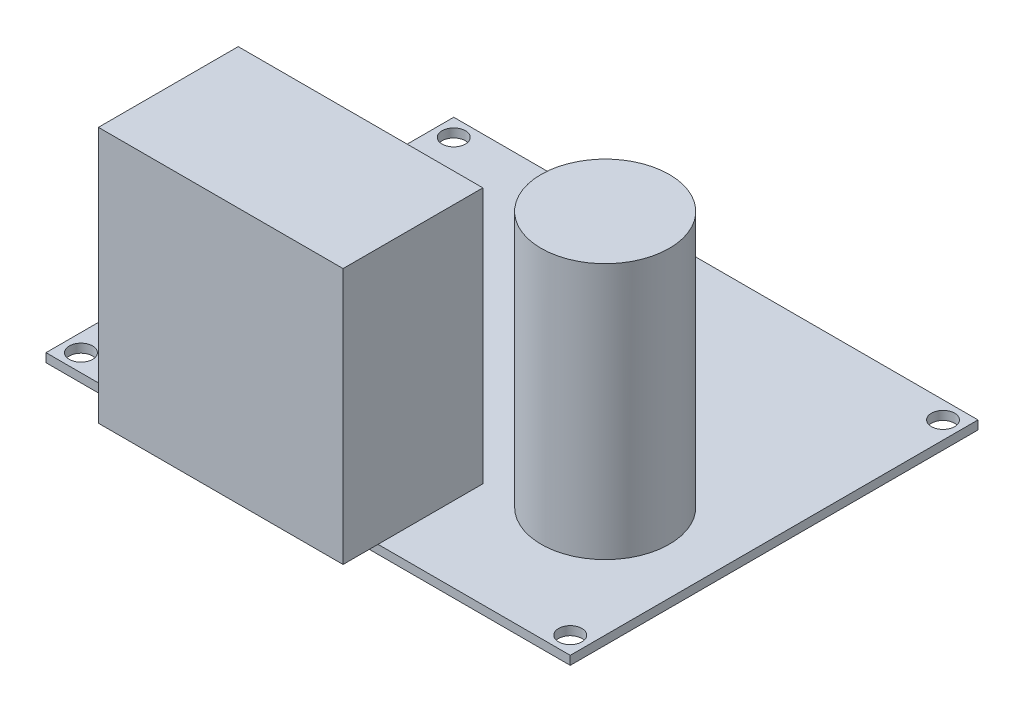
ISO-10303-21;
HEADER;
FILE_DESCRIPTION(('STEP AP214'),'2;1');
FILE_NAME('part.step','',(''),(''),'','','');
FILE_SCHEMA(('AUTOMOTIVE_DESIGN { 1 0 10303 214 1 1 1 1 }'));
ENDSEC;
DATA;
#1=APPLICATION_CONTEXT('core data for automotive mechanical design processes');
#2=APPLICATION_PROTOCOL_DEFINITION('international standard','automotive_design',2000,#1);
#3=PRODUCT_CONTEXT('',#1,'mechanical');
#4=PRODUCT('Part','Part','',(#3));
#5=PRODUCT_RELATED_PRODUCT_CATEGORY('part','',(#4));
#6=PRODUCT_DEFINITION_FORMATION('','',#4);
#7=PRODUCT_DEFINITION_CONTEXT('part definition',#1,'design');
#8=PRODUCT_DEFINITION('design','',#6,#7);
#9=PRODUCT_DEFINITION_SHAPE('','',#8);
#10=(LENGTH_UNIT() NAMED_UNIT(*) SI_UNIT(.MILLI.,.METRE.));
#11=(NAMED_UNIT(*) PLANE_ANGLE_UNIT() SI_UNIT($,.RADIAN.));
#12=(NAMED_UNIT(*) SI_UNIT($,.STERADIAN.) SOLID_ANGLE_UNIT());
#13=UNCERTAINTY_MEASURE_WITH_UNIT(LENGTH_MEASURE(1.E-05),#10,'distance_accuracy_value','');
#14=(GEOMETRIC_REPRESENTATION_CONTEXT(3) GLOBAL_UNCERTAINTY_ASSIGNED_CONTEXT((#13)) GLOBAL_UNIT_ASSIGNED_CONTEXT((#10,
#11,#12)) REPRESENTATION_CONTEXT('',''));
#15=CARTESIAN_POINT('',(0.,0.,0.));
#16=DIRECTION('',(0.,0.,1.));
#17=DIRECTION('',(1.,0.,0.));
#18=AXIS2_PLACEMENT_3D('',#15,#16,#17);
#19=CARTESIAN_POINT('',(0.,1.5,0.));
#20=DIRECTION('',(0.,-1.,0.));
#21=DIRECTION('',(0.,0.,-1.));
#22=AXIS2_PLACEMENT_3D('',#19,#20,#21);
#23=PLANE('',#22);
#24=CARTESIAN_POINT('',(87.,1.5,-3.));
#25=DIRECTION('',(0.,1.,0.));
#26=DIRECTION('',(0.,0.,1.));
#27=AXIS2_PLACEMENT_3D('',#24,#25,#26);
#28=CIRCLE('',#27,2.);
#29=CARTESIAN_POINT('',(87.,1.5,-1.));
#30=VERTEX_POINT('',#29);
#31=EDGE_CURVE('E157',#30,#30,#28,.T.);
#32=ORIENTED_EDGE('',*,*,#31,.F.);
#33=EDGE_LOOP('',(#32));
#34=FACE_BOUND('',#33,.T.);
#35=CARTESIAN_POINT('',(3.,1.5,-67.0000000000001));
#36=DIRECTION('',(0.,1.,0.));
#37=DIRECTION('',(0.,0.,1.));
#38=AXIS2_PLACEMENT_3D('',#35,#36,#37);
#39=CIRCLE('',#38,2.);
#40=CARTESIAN_POINT('',(3.,1.5,-65.0000000000001));
#41=VERTEX_POINT('',#40);
#42=EDGE_CURVE('E147',#41,#41,#39,.T.);
#43=ORIENTED_EDGE('',*,*,#42,.F.);
#44=EDGE_LOOP('',(#43));
#45=FACE_BOUND('',#44,.T.);
#46=CARTESIAN_POINT('',(3.,1.5,-3.));
#47=DIRECTION('',(0.,1.,0.));
#48=DIRECTION('',(0.,0.,1.));
#49=AXIS2_PLACEMENT_3D('',#46,#47,#48);
#50=CIRCLE('',#49,2.);
#51=CARTESIAN_POINT('',(3.,1.5,-1.));
#52=VERTEX_POINT('',#51);
#53=EDGE_CURVE('E151',#52,#52,#50,.T.);
#54=ORIENTED_EDGE('',*,*,#53,.F.);
#55=EDGE_LOOP('',(#54));
#56=FACE_BOUND('',#55,.T.);
#57=CARTESIAN_POINT('',(87.,1.5,-67.0000000000001));
#58=DIRECTION('',(0.,1.,0.));
#59=DIRECTION('',(0.,0.,1.));
#60=AXIS2_PLACEMENT_3D('',#57,#58,#59);
#61=CIRCLE('',#60,2.);
#62=CARTESIAN_POINT('',(87.,1.5,-65.0000000000001));
#63=VERTEX_POINT('',#62);
#64=EDGE_CURVE('E158',#63,#63,#61,.T.);
#65=ORIENTED_EDGE('',*,*,#64,.F.);
#66=EDGE_LOOP('',(#65));
#67=FACE_BOUND('',#66,.T.);
#68=CARTESIAN_POINT('',(71.,1.5,-25.));
#69=DIRECTION('',(0.,-1.,0.));
#70=DIRECTION('',(0.,0.,-1.));
#71=AXIS2_PLACEMENT_3D('',#68,#69,#70);
#72=CIRCLE('',#71,11.);
#73=CARTESIAN_POINT('',(71.,1.5,-36.));
#74=VERTEX_POINT('',#73);
#75=EDGE_CURVE('E41',#74,#74,#72,.F.);
#76=ORIENTED_EDGE('',*,*,#75,.F.);
#77=EDGE_LOOP('',(#76));
#78=FACE_BOUND('',#77,.T.);
#79=DIRECTION('',(0.,0.,1.));
#80=VECTOR('',#79,1.);
#81=CARTESIAN_POINT('',(15.,1.5,0.));
#82=LINE('',#81,#80);
#83=CARTESIAN_POINT('',(15.,1.5,-18.));
#84=VERTEX_POINT('',#83);
#85=CARTESIAN_POINT('',(15.,1.5,0.));
#86=VERTEX_POINT('',#85);
#87=EDGE_CURVE('E132',#84,#86,#82,.T.);
#88=ORIENTED_EDGE('',*,*,#87,.F.);
#89=DIRECTION('',(-1.,0.,0.));
#90=VECTOR('',#89,1.);
#91=CARTESIAN_POINT('',(15.,1.5,-18.));
#92=LINE('',#91,#90);
#93=CARTESIAN_POINT('',(57.,1.5,-18.));
#94=VERTEX_POINT('',#93);
#95=EDGE_CURVE('E48',#94,#84,#92,.T.);
#96=ORIENTED_EDGE('',*,*,#95,.F.);
#97=DIRECTION('',(0.,0.,-1.));
#98=VECTOR('',#97,1.);
#99=CARTESIAN_POINT('',(57.,1.5,0.));
#100=LINE('',#99,#98);
#101=CARTESIAN_POINT('',(57.,1.5,0.));
#102=VERTEX_POINT('',#101);
#103=EDGE_CURVE('E11',#102,#94,#100,.T.);
#104=ORIENTED_EDGE('',*,*,#103,.F.);
#105=DIRECTION('',(1.,0.,0.));
#106=VECTOR('',#105,1.);
#107=CARTESIAN_POINT('',(0.,1.5,0.));
#108=LINE('',#107,#106);
#109=CARTESIAN_POINT('',(90.,1.5,0.));
#110=VERTEX_POINT('',#109);
#111=EDGE_CURVE('E175',#102,#110,#108,.T.);
#112=ORIENTED_EDGE('',*,*,#111,.T.);
#113=DIRECTION('',(0.,0.,-1.));
#114=VECTOR('',#113,1.);
#115=CARTESIAN_POINT('',(90.,1.5,0.));
#116=LINE('',#115,#114);
#117=CARTESIAN_POINT('',(90.,1.5,-70.0000000000001));
#118=VERTEX_POINT('',#117);
#119=EDGE_CURVE('E180',#110,#118,#116,.T.);
#120=ORIENTED_EDGE('',*,*,#119,.T.);
#121=DIRECTION('',(-1.,0.,0.));
#122=VECTOR('',#121,1.);
#123=CARTESIAN_POINT('',(0.,1.5,-70.0000000000001));
#124=LINE('',#123,#122);
#125=CARTESIAN_POINT('',(0.,1.5,-70.0000000000001));
#126=VERTEX_POINT('',#125);
#127=EDGE_CURVE('E183',#118,#126,#124,.T.);
#128=ORIENTED_EDGE('',*,*,#127,.T.);
#129=DIRECTION('',(0.,0.,1.));
#130=VECTOR('',#129,1.);
#131=CARTESIAN_POINT('',(0.,1.5,0.));
#132=LINE('',#131,#130);
#133=CARTESIAN_POINT('',(0.,1.5,0.));
#134=VERTEX_POINT('',#133);
#135=EDGE_CURVE('E172',#126,#134,#132,.T.);
#136=ORIENTED_EDGE('',*,*,#135,.T.);
#137=EDGE_CURVE('E177',#134,#86,#108,.T.);
#138=ORIENTED_EDGE('',*,*,#137,.T.);
#139=EDGE_LOOP('',(#88,#96,#104,#112,#120,#128,#136,#138));
#140=FACE_BOUND('',#139,.T.);
#141=ADVANCED_FACE('F33',(#34,#45,#56,#67,#78,#140),#23,.F.);
#142=CARTESIAN_POINT('',(0.,1.5,0.));
#143=DIRECTION('',(1.,0.,0.));
#144=DIRECTION('',(0.,0.,-1.));
#145=AXIS2_PLACEMENT_3D('',#142,#143,#144);
#146=PLANE('',#145);
#147=DIRECTION('',(0.,0.,1.));
#148=VECTOR('',#147,1.);
#149=CARTESIAN_POINT('',(0.,0.,0.));
#150=LINE('',#149,#148);
#151=CARTESIAN_POINT('',(0.,0.,-70.0000000000001));
#152=VERTEX_POINT('',#151);
#153=CARTESIAN_POINT('',(0.,0.,0.));
#154=VERTEX_POINT('',#153);
#155=EDGE_CURVE('E169',#152,#154,#150,.T.);
#156=ORIENTED_EDGE('',*,*,#155,.T.);
#157=DIRECTION('',(0.,-1.,0.));
#158=VECTOR('',#157,1.);
#159=CARTESIAN_POINT('',(0.,1.5,0.));
#160=LINE('',#159,#158);
#161=EDGE_CURVE('E201',#134,#154,#160,.T.);
#162=ORIENTED_EDGE('',*,*,#161,.F.);
#163=ORIENTED_EDGE('',*,*,#135,.F.);
#164=DIRECTION('',(0.,-1.,0.));
#165=VECTOR('',#164,1.);
#166=CARTESIAN_POINT('',(0.,1.5,-70.0000000000001));
#167=LINE('',#166,#165);
#168=EDGE_CURVE('E185',#126,#152,#167,.T.);
#169=ORIENTED_EDGE('',*,*,#168,.T.);
#170=EDGE_LOOP('',(#156,#162,#163,#169));
#171=FACE_BOUND('',#170,.T.);
#172=ADVANCED_FACE('F35',(#171),#146,.F.);
#173=CARTESIAN_POINT('',(0.,1.5,0.));
#174=DIRECTION('',(0.,0.,-1.));
#175=DIRECTION('',(-1.,0.,0.));
#176=AXIS2_PLACEMENT_3D('',#173,#174,#175);
#177=PLANE('',#176);
#178=DIRECTION('',(1.,0.,0.));
#179=VECTOR('',#178,1.);
#180=CARTESIAN_POINT('',(0.,0.,0.));
#181=LINE('',#180,#179);
#182=CARTESIAN_POINT('',(90.,0.,0.));
#183=VERTEX_POINT('',#182);
#184=EDGE_CURVE('E188',#154,#183,#181,.T.);
#185=ORIENTED_EDGE('',*,*,#184,.T.);
#186=DIRECTION('',(0.,-1.,0.));
#187=VECTOR('',#186,1.);
#188=CARTESIAN_POINT('',(90.,1.5,0.));
#189=LINE('',#188,#187);
#190=EDGE_CURVE('E198',#110,#183,#189,.T.);
#191=ORIENTED_EDGE('',*,*,#190,.F.);
#192=ORIENTED_EDGE('',*,*,#111,.F.);
#193=EDGE_CURVE('E181',#86,#102,#108,.T.);
#194=ORIENTED_EDGE('',*,*,#193,.F.);
#195=ORIENTED_EDGE('',*,*,#137,.F.);
#196=ORIENTED_EDGE('',*,*,#161,.T.);
#197=EDGE_LOOP('',(#185,#191,#192,#194,#195,#196));
#198=FACE_BOUND('',#197,.T.);
#199=ADVANCED_FACE('F223',(#198),#177,.F.);
#200=CARTESIAN_POINT('',(90.,1.5,0.));
#201=DIRECTION('',(-1.,0.,0.));
#202=DIRECTION('',(0.,0.,1.));
#203=AXIS2_PLACEMENT_3D('',#200,#201,#202);
#204=PLANE('',#203);
#205=DIRECTION('',(0.,0.,-1.));
#206=VECTOR('',#205,1.);
#207=CARTESIAN_POINT('',(90.,0.,0.));
#208=LINE('',#207,#206);
#209=CARTESIAN_POINT('',(90.,0.,-70.0000000000001));
#210=VERTEX_POINT('',#209);
#211=EDGE_CURVE('E190',#183,#210,#208,.T.);
#212=ORIENTED_EDGE('',*,*,#211,.T.);
#213=DIRECTION('',(0.,-1.,0.));
#214=VECTOR('',#213,1.);
#215=CARTESIAN_POINT('',(90.,1.5,-70.0000000000001));
#216=LINE('',#215,#214);
#217=EDGE_CURVE('E195',#118,#210,#216,.T.);
#218=ORIENTED_EDGE('',*,*,#217,.F.);
#219=ORIENTED_EDGE('',*,*,#119,.F.);
#220=ORIENTED_EDGE('',*,*,#190,.T.);
#221=EDGE_LOOP('',(#212,#218,#219,#220));
#222=FACE_BOUND('',#221,.T.);
#223=ADVANCED_FACE('F226',(#222),#204,.F.);
#224=CARTESIAN_POINT('',(0.,1.5,-70.0000000000001));
#225=DIRECTION('',(0.,0.,1.));
#226=DIRECTION('',(1.,0.,0.));
#227=AXIS2_PLACEMENT_3D('',#224,#225,#226);
#228=PLANE('',#227);
#229=DIRECTION('',(-1.,0.,0.));
#230=VECTOR('',#229,1.);
#231=CARTESIAN_POINT('',(0.,0.,-70.0000000000001));
#232=LINE('',#231,#230);
#233=EDGE_CURVE('E176',#210,#152,#232,.T.);
#234=ORIENTED_EDGE('',*,*,#233,.T.);
#235=ORIENTED_EDGE('',*,*,#168,.F.);
#236=ORIENTED_EDGE('',*,*,#127,.F.);
#237=ORIENTED_EDGE('',*,*,#217,.T.);
#238=EDGE_LOOP('',(#234,#235,#236,#237));
#239=FACE_BOUND('',#238,.T.);
#240=ADVANCED_FACE('F231',(#239),#228,.F.);
#241=CARTESIAN_POINT('',(0.,0.,0.));
#242=DIRECTION('',(0.,-1.,0.));
#243=DIRECTION('',(0.,0.,-1.));
#244=AXIS2_PLACEMENT_3D('',#241,#242,#243);
#245=PLANE('',#244);
#246=CARTESIAN_POINT('',(87.,0.,-67.0000000000001));
#247=DIRECTION('',(0.,1.,0.));
#248=DIRECTION('',(0.,0.,1.));
#249=AXIS2_PLACEMENT_3D('',#246,#247,#248);
#250=CIRCLE('',#249,2.);
#251=CARTESIAN_POINT('',(87.,0.,-65.0000000000001));
#252=VERTEX_POINT('',#251);
#253=EDGE_CURVE('E154',#252,#252,#250,.T.);
#254=ORIENTED_EDGE('',*,*,#253,.T.);
#255=EDGE_LOOP('',(#254));
#256=FACE_BOUND('',#255,.T.);
#257=CARTESIAN_POINT('',(3.,0.,-3.));
#258=DIRECTION('',(0.,1.,0.));
#259=DIRECTION('',(0.,0.,1.));
#260=AXIS2_PLACEMENT_3D('',#257,#258,#259);
#261=CIRCLE('',#260,2.);
#262=CARTESIAN_POINT('',(3.,0.,-1.));
#263=VERTEX_POINT('',#262);
#264=EDGE_CURVE('E161',#263,#263,#261,.T.);
#265=ORIENTED_EDGE('',*,*,#264,.T.);
#266=EDGE_LOOP('',(#265));
#267=FACE_BOUND('',#266,.T.);
#268=CARTESIAN_POINT('',(3.,0.,-67.0000000000001));
#269=DIRECTION('',(0.,1.,0.));
#270=DIRECTION('',(0.,0.,1.));
#271=AXIS2_PLACEMENT_3D('',#268,#269,#270);
#272=CIRCLE('',#271,2.);
#273=CARTESIAN_POINT('',(3.,0.,-65.0000000000001));
#274=VERTEX_POINT('',#273);
#275=EDGE_CURVE('E148',#274,#274,#272,.T.);
#276=ORIENTED_EDGE('',*,*,#275,.T.);
#277=EDGE_LOOP('',(#276));
#278=FACE_BOUND('',#277,.T.);
#279=CARTESIAN_POINT('',(87.,0.,-3.));
#280=DIRECTION('',(0.,1.,0.));
#281=DIRECTION('',(0.,0.,1.));
#282=AXIS2_PLACEMENT_3D('',#279,#280,#281);
#283=CIRCLE('',#282,2.);
#284=CARTESIAN_POINT('',(87.,0.,-1.));
#285=VERTEX_POINT('',#284);
#286=EDGE_CURVE('E166',#285,#285,#283,.T.);
#287=ORIENTED_EDGE('',*,*,#286,.T.);
#288=EDGE_LOOP('',(#287));
#289=FACE_BOUND('',#288,.T.);
#290=ORIENTED_EDGE('',*,*,#155,.F.);
#291=ORIENTED_EDGE('',*,*,#233,.F.);
#292=ORIENTED_EDGE('',*,*,#211,.F.);
#293=ORIENTED_EDGE('',*,*,#184,.F.);
#294=EDGE_LOOP('',(#290,#291,#292,#293));
#295=FACE_BOUND('',#294,.T.);
#296=ADVANCED_FACE('F237',(#256,#267,#278,#289,#295),#245,.T.);
#297=CARTESIAN_POINT('',(87.,0.,-3.));
#298=DIRECTION('',(0.,1.,0.));
#299=DIRECTION('',(0.,0.,1.));
#300=AXIS2_PLACEMENT_3D('',#297,#298,#299);
#301=CYLINDRICAL_SURFACE('',#300,2.);
#302=ORIENTED_EDGE('',*,*,#286,.F.);
#303=EDGE_LOOP('',(#302));
#304=FACE_BOUND('',#303,.T.);
#305=ORIENTED_EDGE('',*,*,#31,.T.);
#306=EDGE_LOOP('',(#305));
#307=FACE_BOUND('',#306,.T.);
#308=ADVANCED_FACE('F239',(#304,#307),#301,.F.);
#309=CARTESIAN_POINT('',(3.,0.,-67.0000000000001));
#310=DIRECTION('',(0.,1.,0.));
#311=DIRECTION('',(0.,0.,1.));
#312=AXIS2_PLACEMENT_3D('',#309,#310,#311);
#313=CYLINDRICAL_SURFACE('',#312,2.);
#314=ORIENTED_EDGE('',*,*,#275,.F.);
#315=EDGE_LOOP('',(#314));
#316=FACE_BOUND('',#315,.T.);
#317=ORIENTED_EDGE('',*,*,#42,.T.);
#318=EDGE_LOOP('',(#317));
#319=FACE_BOUND('',#318,.T.);
#320=ADVANCED_FACE('F246',(#316,#319),#313,.F.);
#321=CARTESIAN_POINT('',(3.,0.,-3.));
#322=DIRECTION('',(0.,1.,0.));
#323=DIRECTION('',(0.,0.,1.));
#324=AXIS2_PLACEMENT_3D('',#321,#322,#323);
#325=CYLINDRICAL_SURFACE('',#324,2.);
#326=ORIENTED_EDGE('',*,*,#264,.F.);
#327=EDGE_LOOP('',(#326));
#328=FACE_BOUND('',#327,.T.);
#329=ORIENTED_EDGE('',*,*,#53,.T.);
#330=EDGE_LOOP('',(#329));
#331=FACE_BOUND('',#330,.T.);
#332=ADVANCED_FACE('F351',(#328,#331),#325,.F.);
#333=CARTESIAN_POINT('',(87.,0.,-67.0000000000001));
#334=DIRECTION('',(0.,1.,0.));
#335=DIRECTION('',(0.,0.,1.));
#336=AXIS2_PLACEMENT_3D('',#333,#334,#335);
#337=CYLINDRICAL_SURFACE('',#336,2.);
#338=ORIENTED_EDGE('',*,*,#253,.F.);
#339=EDGE_LOOP('',(#338));
#340=FACE_BOUND('',#339,.T.);
#341=ORIENTED_EDGE('',*,*,#64,.T.);
#342=EDGE_LOOP('',(#341));
#343=FACE_BOUND('',#342,.T.);
#344=ADVANCED_FACE('F271',(#340,#343),#337,.F.);
#345=CARTESIAN_POINT('',(71.,45.5,-25.));
#346=DIRECTION('',(0.,-1.,0.));
#347=DIRECTION('',(0.,0.,-1.));
#348=AXIS2_PLACEMENT_3D('',#345,#346,#347);
#349=CYLINDRICAL_SURFACE('',#348,11.);
#350=CARTESIAN_POINT('',(71.,45.5,-25.));
#351=DIRECTION('',(0.,1.,0.));
#352=DIRECTION('',(0.,0.,1.));
#353=AXIS2_PLACEMENT_3D('',#350,#351,#352);
#354=CIRCLE('',#353,11.);
#355=CARTESIAN_POINT('',(71.,45.5,-14.));
#356=VERTEX_POINT('',#355);
#357=EDGE_CURVE('E120',#356,#356,#354,.T.);
#358=ORIENTED_EDGE('',*,*,#357,.F.);
#359=EDGE_LOOP('',(#358));
#360=FACE_BOUND('',#359,.T.);
#361=ORIENTED_EDGE('',*,*,#75,.T.);
#362=EDGE_LOOP('',(#361));
#363=FACE_BOUND('',#362,.T.);
#364=ADVANCED_FACE('F206',(#360,#363),#349,.T.);
#365=CARTESIAN_POINT('',(71.,45.5,-25.));
#366=DIRECTION('',(0.,1.,0.));
#367=DIRECTION('',(0.,0.,1.));
#368=AXIS2_PLACEMENT_3D('',#365,#366,#367);
#369=PLANE('',#368);
#370=ORIENTED_EDGE('',*,*,#357,.T.);
#371=EDGE_LOOP('',(#370));
#372=FACE_BOUND('',#371,.T.);
#373=ADVANCED_FACE('F284',(#372),#369,.T.);
#374=CARTESIAN_POINT('',(0.,1.5,0.));
#375=DIRECTION('',(0.,1.,0.));
#376=DIRECTION('',(0.,0.,1.));
#377=AXIS2_PLACEMENT_3D('',#374,#375,#376);
#378=PLANE('',#377);
#379=CARTESIAN_POINT('',(15.,1.5,6.));
#380=VERTEX_POINT('',#379);
#381=EDGE_CURVE('E116',#86,#380,#82,.T.);
#382=ORIENTED_EDGE('',*,*,#381,.F.);
#383=ORIENTED_EDGE('',*,*,#193,.T.);
#384=DIRECTION('',(0.,0.,-1.));
#385=VECTOR('',#384,1.);
#386=CARTESIAN_POINT('',(57.,1.5,-18.));
#387=LINE('',#386,#385);
#388=CARTESIAN_POINT('',(57.,1.5,6.));
#389=VERTEX_POINT('',#388);
#390=EDGE_CURVE('E136',#389,#102,#387,.T.);
#391=ORIENTED_EDGE('',*,*,#390,.F.);
#392=DIRECTION('',(1.,0.,0.));
#393=VECTOR('',#392,1.);
#394=CARTESIAN_POINT('',(15.,1.5,6.));
#395=LINE('',#394,#393);
#396=EDGE_CURVE('E134',#380,#389,#395,.T.);
#397=ORIENTED_EDGE('',*,*,#396,.F.);
#398=EDGE_LOOP('',(#382,#383,#391,#397));
#399=FACE_BOUND('',#398,.T.);
#400=ADVANCED_FACE('F218',(#399),#378,.F.);
#401=CARTESIAN_POINT('',(15.,45.5,0.));
#402=DIRECTION('',(1.,0.,0.));
#403=DIRECTION('',(0.,0.,-1.));
#404=AXIS2_PLACEMENT_3D('',#401,#402,#403);
#405=PLANE('',#404);
#406=ORIENTED_EDGE('',*,*,#87,.T.);
#407=ORIENTED_EDGE('',*,*,#381,.T.);
#408=DIRECTION('',(0.,-1.,0.));
#409=VECTOR('',#408,1.);
#410=CARTESIAN_POINT('',(15.,45.5,6.));
#411=LINE('',#410,#409);
#412=CARTESIAN_POINT('',(15.,45.5,6.));
#413=VERTEX_POINT('',#412);
#414=EDGE_CURVE('E112',#413,#380,#411,.T.);
#415=ORIENTED_EDGE('',*,*,#414,.F.);
#416=DIRECTION('',(0.,0.,1.));
#417=VECTOR('',#416,1.);
#418=CARTESIAN_POINT('',(15.,45.5,-18.));
#419=LINE('',#418,#417);
#420=CARTESIAN_POINT('',(15.,45.5,-18.));
#421=VERTEX_POINT('',#420);
#422=EDGE_CURVE('E99',#421,#413,#419,.T.);
#423=ORIENTED_EDGE('',*,*,#422,.F.);
#424=DIRECTION('',(0.,-1.,0.));
#425=VECTOR('',#424,1.);
#426=CARTESIAN_POINT('',(15.,45.5,-18.));
#427=LINE('',#426,#425);
#428=EDGE_CURVE('E131',#421,#84,#427,.T.);
#429=ORIENTED_EDGE('',*,*,#428,.T.);
#430=EDGE_LOOP('',(#406,#407,#415,#423,#429));
#431=FACE_BOUND('',#430,.T.);
#432=ADVANCED_FACE('F114',(#431),#405,.F.);
#433=CARTESIAN_POINT('',(15.,45.5,6.));
#434=DIRECTION('',(0.,0.,-1.));
#435=DIRECTION('',(-1.,0.,0.));
#436=AXIS2_PLACEMENT_3D('',#433,#434,#435);
#437=PLANE('',#436);
#438=ORIENTED_EDGE('',*,*,#396,.T.);
#439=DIRECTION('',(0.,-1.,0.));
#440=VECTOR('',#439,1.);
#441=CARTESIAN_POINT('',(57.,45.5,6.));
#442=LINE('',#441,#440);
#443=CARTESIAN_POINT('',(57.,45.5,6.));
#444=VERTEX_POINT('',#443);
#445=EDGE_CURVE('E121',#444,#389,#442,.T.);
#446=ORIENTED_EDGE('',*,*,#445,.F.);
#447=DIRECTION('',(1.,0.,0.));
#448=VECTOR('',#447,1.);
#449=CARTESIAN_POINT('',(15.,45.5,6.));
#450=LINE('',#449,#448);
#451=EDGE_CURVE('E103',#413,#444,#450,.T.);
#452=ORIENTED_EDGE('',*,*,#451,.F.);
#453=ORIENTED_EDGE('',*,*,#414,.T.);
#454=EDGE_LOOP('',(#438,#446,#452,#453));
#455=FACE_BOUND('',#454,.T.);
#456=ADVANCED_FACE('F123',(#455),#437,.F.);
#457=CARTESIAN_POINT('',(57.,45.5,-18.));
#458=DIRECTION('',(-1.,0.,0.));
#459=DIRECTION('',(0.,0.,1.));
#460=AXIS2_PLACEMENT_3D('',#457,#458,#459);
#461=PLANE('',#460);
#462=ORIENTED_EDGE('',*,*,#390,.T.);
#463=ORIENTED_EDGE('',*,*,#103,.T.);
#464=DIRECTION('',(0.,-1.,0.));
#465=VECTOR('',#464,1.);
#466=CARTESIAN_POINT('',(57.,45.5,-18.));
#467=LINE('',#466,#465);
#468=CARTESIAN_POINT('',(57.,45.5,-18.));
#469=VERTEX_POINT('',#468);
#470=EDGE_CURVE('E141',#469,#94,#467,.T.);
#471=ORIENTED_EDGE('',*,*,#470,.F.);
#472=DIRECTION('',(0.,0.,-1.));
#473=VECTOR('',#472,1.);
#474=CARTESIAN_POINT('',(57.,45.5,6.));
#475=LINE('',#474,#473);
#476=EDGE_CURVE('E126',#444,#469,#475,.T.);
#477=ORIENTED_EDGE('',*,*,#476,.F.);
#478=ORIENTED_EDGE('',*,*,#445,.T.);
#479=EDGE_LOOP('',(#462,#463,#471,#477,#478));
#480=FACE_BOUND('',#479,.T.);
#481=ADVANCED_FACE('F215',(#480),#461,.F.);
#482=CARTESIAN_POINT('',(15.,45.5,-18.));
#483=DIRECTION('',(0.,0.,1.));
#484=DIRECTION('',(1.,0.,0.));
#485=AXIS2_PLACEMENT_3D('',#482,#483,#484);
#486=PLANE('',#485);
#487=ORIENTED_EDGE('',*,*,#95,.T.);
#488=ORIENTED_EDGE('',*,*,#428,.F.);
#489=DIRECTION('',(-1.,0.,0.));
#490=VECTOR('',#489,1.);
#491=CARTESIAN_POINT('',(15.,45.5,-18.));
#492=LINE('',#491,#490);
#493=EDGE_CURVE('E106',#469,#421,#492,.T.);
#494=ORIENTED_EDGE('',*,*,#493,.F.);
#495=ORIENTED_EDGE('',*,*,#470,.T.);
#496=EDGE_LOOP('',(#487,#488,#494,#495));
#497=FACE_BOUND('',#496,.T.);
#498=ADVANCED_FACE('F212',(#497),#486,.F.);
#499=CARTESIAN_POINT('',(0.,45.5,0.));
#500=DIRECTION('',(0.,1.,0.));
#501=DIRECTION('',(0.,0.,1.));
#502=AXIS2_PLACEMENT_3D('',#499,#500,#501);
#503=PLANE('',#502);
#504=ORIENTED_EDGE('',*,*,#422,.T.);
#505=ORIENTED_EDGE('',*,*,#451,.T.);
#506=ORIENTED_EDGE('',*,*,#476,.T.);
#507=ORIENTED_EDGE('',*,*,#493,.T.);
#508=EDGE_LOOP('',(#504,#505,#506,#507));
#509=FACE_BOUND('',#508,.T.);
#510=ADVANCED_FACE('F101',(#509),#503,.T.);
#511=CLOSED_SHELL('',(#141,#172,#199,#223,#240,#296,#308,#320,#332,#344,#364,#373,#400,#432,
#456,#481,#498,#510));
#512=MANIFOLD_SOLID_BREP('B2',#511);
#513=ADVANCED_BREP_SHAPE_REPRESENTATION('',(#18,#512),#14);
#514=SHAPE_DEFINITION_REPRESENTATION(#9,#513);
ENDSEC;
END-ISO-10303-21;
